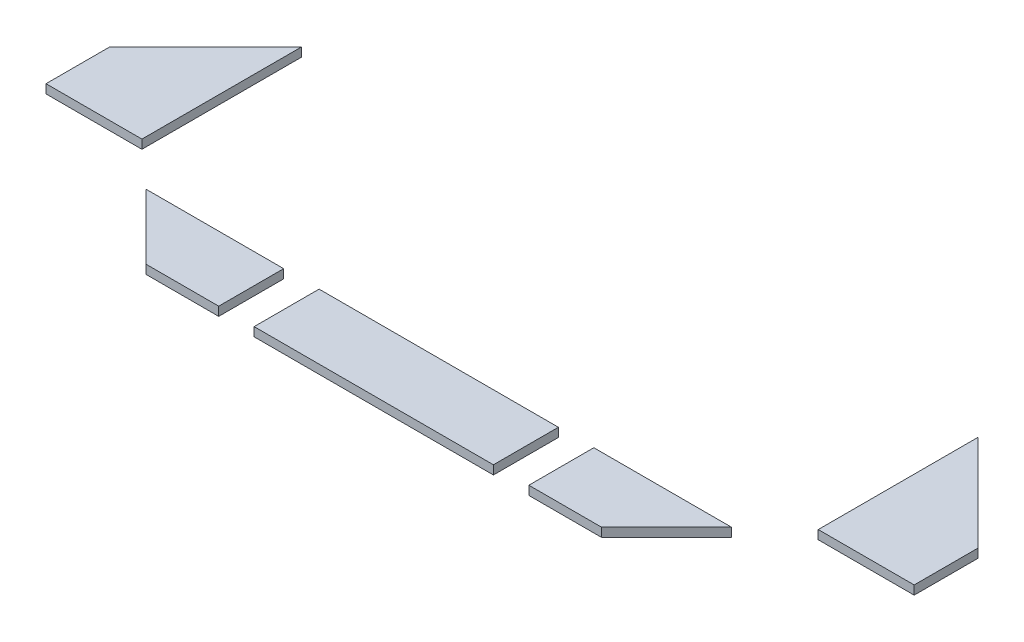
ISO-10303-21;
HEADER;
FILE_DESCRIPTION(('STEP AP214'),'2;1');
FILE_NAME('part.step','',(''),(''),'','','');
FILE_SCHEMA(('AUTOMOTIVE_DESIGN { 1 0 10303 214 1 1 1 1 }'));
ENDSEC;
DATA;
#1=APPLICATION_CONTEXT('core data for automotive mechanical design processes');
#2=APPLICATION_PROTOCOL_DEFINITION('international standard','automotive_design',2000,#1);
#3=PRODUCT_CONTEXT('',#1,'mechanical');
#4=PRODUCT('Part','Part','',(#3));
#5=PRODUCT_RELATED_PRODUCT_CATEGORY('part','',(#4));
#6=PRODUCT_DEFINITION_FORMATION('','',#4);
#7=PRODUCT_DEFINITION_CONTEXT('part definition',#1,'design');
#8=PRODUCT_DEFINITION('design','',#6,#7);
#9=PRODUCT_DEFINITION_SHAPE('','',#8);
#10=(LENGTH_UNIT() NAMED_UNIT(*) SI_UNIT(.MILLI.,.METRE.));
#11=(NAMED_UNIT(*) PLANE_ANGLE_UNIT() SI_UNIT($,.RADIAN.));
#12=(NAMED_UNIT(*) SI_UNIT($,.STERADIAN.) SOLID_ANGLE_UNIT());
#13=UNCERTAINTY_MEASURE_WITH_UNIT(LENGTH_MEASURE(1.E-05),#10,'distance_accuracy_value','');
#14=(GEOMETRIC_REPRESENTATION_CONTEXT(3) GLOBAL_UNCERTAINTY_ASSIGNED_CONTEXT((#13)) GLOBAL_UNIT_ASSIGNED_CONTEXT((#10,
#11,#12)) REPRESENTATION_CONTEXT('',''));
#15=CARTESIAN_POINT('',(0.,0.,0.));
#16=DIRECTION('',(0.,0.,1.));
#17=DIRECTION('',(1.,0.,0.));
#18=AXIS2_PLACEMENT_3D('',#15,#16,#17);
#19=CARTESIAN_POINT('',(59.3076118445742,1.5,-0.499999999999998));
#20=DIRECTION('',(-0.707106781186547,0.,-0.707106781186548));
#21=DIRECTION('',(-0.707106781186548,0.,0.707106781186547));
#22=AXIS2_PLACEMENT_3D('',#19,#20,#21);
#23=PLANE('',#22);
#24=DIRECTION('',(0.707106781186548,0.,-0.707106781186547));
#25=VECTOR('',#24,1.);
#26=CARTESIAN_POINT('',(59.3076118445742,0.,-0.499999999999998));
#27=LINE('',#26,#25);
#28=CARTESIAN_POINT('',(59.3076118445742,0.,-0.499999999999998));
#29=VERTEX_POINT('',#28);
#30=CARTESIAN_POINT('',(70.3076118445748,0.,-11.5000000000006));
#31=VERTEX_POINT('',#30);
#32=EDGE_CURVE('E107',#29,#31,#27,.T.);
#33=ORIENTED_EDGE('',*,*,#32,.T.);
#34=DIRECTION('',(0.,-1.,0.));
#35=VECTOR('',#34,1.);
#36=CARTESIAN_POINT('',(70.3076118445748,1.5,-11.5000000000006));
#37=LINE('',#36,#35);
#38=CARTESIAN_POINT('',(70.3076118445748,1.5,-11.5000000000006));
#39=VERTEX_POINT('',#38);
#40=EDGE_CURVE('E12',#39,#31,#37,.T.);
#41=ORIENTED_EDGE('',*,*,#40,.F.);
#42=DIRECTION('',(0.707106781186548,0.,-0.707106781186547));
#43=VECTOR('',#42,1.);
#44=CARTESIAN_POINT('',(59.3076118445742,1.5,-0.499999999999998));
#45=LINE('',#44,#43);
#46=CARTESIAN_POINT('',(59.3076118445742,1.5,-0.499999999999998));
#47=VERTEX_POINT('',#46);
#48=EDGE_CURVE('E95',#47,#39,#45,.T.);
#49=ORIENTED_EDGE('',*,*,#48,.F.);
#50=DIRECTION('',(0.,-1.,0.));
#51=VECTOR('',#50,1.);
#52=CARTESIAN_POINT('',(59.3076118445742,1.5,-0.499999999999998));
#53=LINE('',#52,#51);
#54=EDGE_CURVE('E103',#47,#29,#53,.T.);
#55=ORIENTED_EDGE('',*,*,#54,.T.);
#56=EDGE_LOOP('',(#33,#41,#49,#55));
#57=FACE_BOUND('',#56,.T.);
#58=ADVANCED_FACE('F44',(#57),#23,.F.);
#59=CARTESIAN_POINT('',(70.3076118445748,1.5,-11.5000000000006));
#60=DIRECTION('',(0.,0.,1.));
#61=DIRECTION('',(1.,0.,0.));
#62=AXIS2_PLACEMENT_3D('',#59,#60,#61);
#63=PLANE('',#62);
#64=DIRECTION('',(-1.,0.,0.));
#65=VECTOR('',#64,1.);
#66=CARTESIAN_POINT('',(70.3076118445748,0.,-11.5000000000006));
#67=LINE('',#66,#65);
#68=CARTESIAN_POINT('',(47.0147186257613,0.,-11.5000000000006));
#69=VERTEX_POINT('',#68);
#70=EDGE_CURVE('E99',#31,#69,#67,.T.);
#71=ORIENTED_EDGE('',*,*,#70,.T.);
#72=DIRECTION('',(0.,-1.,0.));
#73=VECTOR('',#72,1.);
#74=CARTESIAN_POINT('',(47.0147186257613,1.5,-11.5000000000006));
#75=LINE('',#74,#73);
#76=CARTESIAN_POINT('',(47.0147186257613,1.5,-11.5000000000006));
#77=VERTEX_POINT('',#76);
#78=EDGE_CURVE('E52',#77,#69,#75,.T.);
#79=ORIENTED_EDGE('',*,*,#78,.F.);
#80=DIRECTION('',(-1.,0.,0.));
#81=VECTOR('',#80,1.);
#82=CARTESIAN_POINT('',(70.3076118445748,1.5,-11.5000000000006));
#83=LINE('',#82,#81);
#84=EDGE_CURVE('E90',#39,#77,#83,.T.);
#85=ORIENTED_EDGE('',*,*,#84,.F.);
#86=ORIENTED_EDGE('',*,*,#40,.T.);
#87=EDGE_LOOP('',(#71,#79,#85,#86));
#88=FACE_BOUND('',#87,.T.);
#89=ADVANCED_FACE('F98',(#88),#63,.F.);
#90=CARTESIAN_POINT('',(47.0147186257613,1.5,-11.5000000000006));
#91=DIRECTION('',(1.,0.,0.));
#92=DIRECTION('',(0.,0.,-1.));
#93=AXIS2_PLACEMENT_3D('',#90,#91,#92);
#94=PLANE('',#93);
#95=DIRECTION('',(0.,0.,1.));
#96=VECTOR('',#95,1.);
#97=CARTESIAN_POINT('',(47.0147186257613,0.,-11.5000000000006));
#98=LINE('',#97,#96);
#99=CARTESIAN_POINT('',(47.0147186257613,0.,-0.5));
#100=VERTEX_POINT('',#99);
#101=EDGE_CURVE('E77',#69,#100,#98,.T.);
#102=ORIENTED_EDGE('',*,*,#101,.T.);
#103=DIRECTION('',(0.,-1.,0.));
#104=VECTOR('',#103,1.);
#105=CARTESIAN_POINT('',(47.0147186257613,1.5,-0.5));
#106=LINE('',#105,#104);
#107=CARTESIAN_POINT('',(47.0147186257613,1.5,-0.5));
#108=VERTEX_POINT('',#107);
#109=EDGE_CURVE('E100',#108,#100,#106,.T.);
#110=ORIENTED_EDGE('',*,*,#109,.F.);
#111=DIRECTION('',(0.,0.,1.));
#112=VECTOR('',#111,1.);
#113=CARTESIAN_POINT('',(47.0147186257613,1.5,-11.5000000000006));
#114=LINE('',#113,#112);
#115=EDGE_CURVE('E93',#77,#108,#114,.T.);
#116=ORIENTED_EDGE('',*,*,#115,.F.);
#117=ORIENTED_EDGE('',*,*,#78,.T.);
#118=EDGE_LOOP('',(#102,#110,#116,#117));
#119=FACE_BOUND('',#118,.T.);
#120=ADVANCED_FACE('F101',(#119),#94,.F.);
#121=CARTESIAN_POINT('',(47.0147186257613,1.5,-0.5));
#122=DIRECTION('',(0.,0.,-1.));
#123=DIRECTION('',(-1.,0.,0.));
#124=AXIS2_PLACEMENT_3D('',#121,#122,#123);
#125=PLANE('',#124);
#126=DIRECTION('',(1.,0.,0.));
#127=VECTOR('',#126,1.);
#128=CARTESIAN_POINT('',(47.0147186257613,0.,-0.5));
#129=LINE('',#128,#127);
#130=EDGE_CURVE('E83',#100,#29,#129,.T.);
#131=ORIENTED_EDGE('',*,*,#130,.T.);
#132=ORIENTED_EDGE('',*,*,#54,.F.);
#133=DIRECTION('',(1.,0.,0.));
#134=VECTOR('',#133,1.);
#135=CARTESIAN_POINT('',(47.0147186257613,1.5,-0.5));
#136=LINE('',#135,#134);
#137=EDGE_CURVE('E60',#108,#47,#136,.T.);
#138=ORIENTED_EDGE('',*,*,#137,.F.);
#139=ORIENTED_EDGE('',*,*,#109,.T.);
#140=EDGE_LOOP('',(#131,#132,#138,#139));
#141=FACE_BOUND('',#140,.T.);
#142=ADVANCED_FACE('F114',(#141),#125,.F.);
#143=CARTESIAN_POINT('',(0.,1.5,0.));
#144=DIRECTION('',(0.,1.,0.));
#145=DIRECTION('',(0.,0.,1.));
#146=AXIS2_PLACEMENT_3D('',#143,#144,#145);
#147=PLANE('',#146);
#148=ORIENTED_EDGE('',*,*,#48,.T.);
#149=ORIENTED_EDGE('',*,*,#84,.T.);
#150=ORIENTED_EDGE('',*,*,#115,.T.);
#151=ORIENTED_EDGE('',*,*,#137,.T.);
#152=EDGE_LOOP('',(#148,#149,#150,#151));
#153=FACE_BOUND('',#152,.T.);
#154=ADVANCED_FACE('F91',(#153),#147,.T.);
#155=CARTESIAN_POINT('',(0.,0.,0.));
#156=DIRECTION('',(0.,1.,0.));
#157=DIRECTION('',(0.,0.,1.));
#158=AXIS2_PLACEMENT_3D('',#155,#156,#157);
#159=PLANE('',#158);
#160=ORIENTED_EDGE('',*,*,#32,.F.);
#161=ORIENTED_EDGE('',*,*,#130,.F.);
#162=ORIENTED_EDGE('',*,*,#101,.F.);
#163=ORIENTED_EDGE('',*,*,#70,.F.);
#164=EDGE_LOOP('',(#160,#161,#162,#163));
#165=FACE_BOUND('',#164,.T.);
#166=ADVANCED_FACE('F117',(#165),#159,.F.);
#167=CLOSED_SHELL('',(#58,#89,#120,#142,#154,#166));
#168=MANIFOLD_SOLID_BREP('B2',#167);
#169=CARTESIAN_POINT('',(78.0147186257614,1.5,-18.5000000000006));
#170=DIRECTION('',(1.,0.,0.));
#171=DIRECTION('',(0.,0.,-1.));
#172=AXIS2_PLACEMENT_3D('',#169,#170,#171);
#173=PLANE('',#172);
#174=DIRECTION('',(0.,0.,1.));
#175=VECTOR('',#174,1.);
#176=CARTESIAN_POINT('',(78.0147186257614,0.,-18.5000000000006));
#177=LINE('',#176,#175);
#178=CARTESIAN_POINT('',(78.0147186257614,0.,-45.5000000000006));
#179=VERTEX_POINT('',#178);
#180=CARTESIAN_POINT('',(78.0147186257614,0.,-18.5000000000006));
#181=VERTEX_POINT('',#180);
#182=EDGE_CURVE('E252',#179,#181,#177,.T.);
#183=ORIENTED_EDGE('',*,*,#182,.T.);
#184=DIRECTION('',(0.,-1.,0.));
#185=VECTOR('',#184,1.);
#186=CARTESIAN_POINT('',(78.0147186257614,1.5,-18.5000000000006));
#187=LINE('',#186,#185);
#188=CARTESIAN_POINT('',(78.0147186257614,1.5,-18.5000000000006));
#189=VERTEX_POINT('',#188);
#190=EDGE_CURVE('E42',#189,#181,#187,.T.);
#191=ORIENTED_EDGE('',*,*,#190,.F.);
#192=DIRECTION('',(0.,0.,1.));
#193=VECTOR('',#192,1.);
#194=CARTESIAN_POINT('',(78.0147186257614,1.5,-18.5000000000006));
#195=LINE('',#194,#193);
#196=CARTESIAN_POINT('',(78.0147186257614,1.5,-45.5000000000006));
#197=VERTEX_POINT('',#196);
#198=EDGE_CURVE('E260',#197,#189,#195,.T.);
#199=ORIENTED_EDGE('',*,*,#198,.F.);
#200=DIRECTION('',(0.,-1.,0.));
#201=VECTOR('',#200,1.);
#202=CARTESIAN_POINT('',(78.0147186257614,1.5,-45.5000000000006));
#203=LINE('',#202,#201);
#204=EDGE_CURVE('E248',#197,#179,#203,.T.);
#205=ORIENTED_EDGE('',*,*,#204,.T.);
#206=EDGE_LOOP('',(#183,#191,#199,#205));
#207=FACE_BOUND('',#206,.T.);
#208=ADVANCED_FACE('F178',(#207),#173,.F.);
#209=CARTESIAN_POINT('',(94.2573593128806,1.5,-18.5000000000006));
#210=DIRECTION('',(0.,0.,-1.));
#211=DIRECTION('',(-1.,0.,0.));
#212=AXIS2_PLACEMENT_3D('',#209,#210,#211);
#213=PLANE('',#212);
#214=DIRECTION('',(1.,0.,0.));
#215=VECTOR('',#214,1.);
#216=CARTESIAN_POINT('',(94.2573593128806,0.,-18.5000000000006));
#217=LINE('',#216,#215);
#218=CARTESIAN_POINT('',(94.2573593128806,0.,-18.5000000000006));
#219=VERTEX_POINT('',#218);
#220=EDGE_CURVE('E255',#181,#219,#217,.T.);
#221=ORIENTED_EDGE('',*,*,#220,.T.);
#222=DIRECTION('',(0.,-1.,0.));
#223=VECTOR('',#222,1.);
#224=CARTESIAN_POINT('',(94.2573593128806,1.5,-18.5000000000006));
#225=LINE('',#224,#223);
#226=CARTESIAN_POINT('',(94.2573593128806,1.5,-18.5000000000006));
#227=VERTEX_POINT('',#226);
#228=EDGE_CURVE('E186',#227,#219,#225,.T.);
#229=ORIENTED_EDGE('',*,*,#228,.F.);
#230=DIRECTION('',(1.,0.,0.));
#231=VECTOR('',#230,1.);
#232=CARTESIAN_POINT('',(94.2573593128806,1.5,-18.5000000000006));
#233=LINE('',#232,#231);
#234=EDGE_CURVE('E228',#189,#227,#233,.T.);
#235=ORIENTED_EDGE('',*,*,#234,.F.);
#236=ORIENTED_EDGE('',*,*,#190,.T.);
#237=EDGE_LOOP('',(#221,#229,#235,#236));
#238=FACE_BOUND('',#237,.T.);
#239=ADVANCED_FACE('F279',(#238),#213,.F.);
#240=CARTESIAN_POINT('',(94.2573593128806,1.5,-29.3076118445755));
#241=DIRECTION('',(-1.,0.,0.));
#242=DIRECTION('',(0.,0.,1.));
#243=AXIS2_PLACEMENT_3D('',#240,#241,#242);
#244=PLANE('',#243);
#245=DIRECTION('',(0.,0.,-1.));
#246=VECTOR('',#245,1.);
#247=CARTESIAN_POINT('',(94.2573593128806,0.,-29.3076118445755));
#248=LINE('',#247,#246);
#249=CARTESIAN_POINT('',(94.2573593128806,0.,-29.3076118445755));
#250=VERTEX_POINT('',#249);
#251=EDGE_CURVE('E243',#219,#250,#248,.T.);
#252=ORIENTED_EDGE('',*,*,#251,.T.);
#253=DIRECTION('',(0.,-1.,0.));
#254=VECTOR('',#253,1.);
#255=CARTESIAN_POINT('',(94.2573593128806,1.5,-29.3076118445755));
#256=LINE('',#255,#254);
#257=CARTESIAN_POINT('',(94.2573593128806,1.5,-29.3076118445755));
#258=VERTEX_POINT('',#257);
#259=EDGE_CURVE('E240',#258,#250,#256,.T.);
#260=ORIENTED_EDGE('',*,*,#259,.F.);
#261=DIRECTION('',(0.,0.,-1.));
#262=VECTOR('',#261,1.);
#263=CARTESIAN_POINT('',(94.2573593128806,1.5,-29.3076118445755));
#264=LINE('',#263,#262);
#265=EDGE_CURVE('E232',#227,#258,#264,.T.);
#266=ORIENTED_EDGE('',*,*,#265,.F.);
#267=ORIENTED_EDGE('',*,*,#228,.T.);
#268=EDGE_LOOP('',(#252,#260,#266,#267));
#269=FACE_BOUND('',#268,.T.);
#270=ADVANCED_FACE('F241',(#269),#244,.F.);
#271=CARTESIAN_POINT('',(78.0649711574555,1.5,-45.5000000000006));
#272=DIRECTION('',(-0.707106781186548,0.,0.707106781186547));
#273=DIRECTION('',(0.707106781186547,0.,0.707106781186548));
#274=AXIS2_PLACEMENT_3D('',#271,#272,#273);
#275=PLANE('',#274);
#276=DIRECTION('',(-0.707106781186547,0.,-0.707106781186548));
#277=VECTOR('',#276,1.);
#278=CARTESIAN_POINT('',(78.0649711574555,0.,-45.5000000000006));
#279=LINE('',#278,#277);
#280=CARTESIAN_POINT('',(78.0649711574555,0.,-45.5000000000006));
#281=VERTEX_POINT('',#280);
#282=EDGE_CURVE('E214',#250,#281,#279,.T.);
#283=ORIENTED_EDGE('',*,*,#282,.T.);
#284=DIRECTION('',(0.,-1.,0.));
#285=VECTOR('',#284,1.);
#286=CARTESIAN_POINT('',(78.0649711574555,1.5,-45.5000000000006));
#287=LINE('',#286,#285);
#288=CARTESIAN_POINT('',(78.0649711574555,1.5,-45.5000000000006));
#289=VERTEX_POINT('',#288);
#290=EDGE_CURVE('E244',#289,#281,#287,.T.);
#291=ORIENTED_EDGE('',*,*,#290,.F.);
#292=DIRECTION('',(-0.707106781186547,0.,-0.707106781186548));
#293=VECTOR('',#292,1.);
#294=CARTESIAN_POINT('',(78.0649711574555,1.5,-45.5000000000006));
#295=LINE('',#294,#293);
#296=EDGE_CURVE('E236',#258,#289,#295,.T.);
#297=ORIENTED_EDGE('',*,*,#296,.F.);
#298=ORIENTED_EDGE('',*,*,#259,.T.);
#299=EDGE_LOOP('',(#283,#291,#297,#298));
#300=FACE_BOUND('',#299,.T.);
#301=ADVANCED_FACE('F246',(#300),#275,.F.);
#302=CARTESIAN_POINT('',(78.0147186257614,1.5,-45.5000000000006));
#303=DIRECTION('',(0.,0.,1.));
#304=DIRECTION('',(1.,0.,0.));
#305=AXIS2_PLACEMENT_3D('',#302,#303,#304);
#306=PLANE('',#305);
#307=DIRECTION('',(-1.,0.,0.));
#308=VECTOR('',#307,1.);
#309=CARTESIAN_POINT('',(78.0147186257614,0.,-45.5000000000006));
#310=LINE('',#309,#308);
#311=EDGE_CURVE('E220',#281,#179,#310,.T.);
#312=ORIENTED_EDGE('',*,*,#311,.T.);
#313=ORIENTED_EDGE('',*,*,#204,.F.);
#314=DIRECTION('',(-1.,0.,0.));
#315=VECTOR('',#314,1.);
#316=CARTESIAN_POINT('',(78.0147186257614,1.5,-45.5000000000006));
#317=LINE('',#316,#315);
#318=EDGE_CURVE('E194',#289,#197,#317,.T.);
#319=ORIENTED_EDGE('',*,*,#318,.F.);
#320=ORIENTED_EDGE('',*,*,#290,.T.);
#321=EDGE_LOOP('',(#312,#313,#319,#320));
#322=FACE_BOUND('',#321,.T.);
#323=ADVANCED_FACE('F268',(#322),#306,.F.);
#324=CARTESIAN_POINT('',(0.,1.5,0.));
#325=DIRECTION('',(0.,-1.,0.));
#326=DIRECTION('',(0.,0.,-1.));
#327=AXIS2_PLACEMENT_3D('',#324,#325,#326);
#328=PLANE('',#327);
#329=ORIENTED_EDGE('',*,*,#198,.T.);
#330=ORIENTED_EDGE('',*,*,#234,.T.);
#331=ORIENTED_EDGE('',*,*,#265,.T.);
#332=ORIENTED_EDGE('',*,*,#296,.T.);
#333=ORIENTED_EDGE('',*,*,#318,.T.);
#334=EDGE_LOOP('',(#329,#330,#331,#332,#333));
#335=FACE_BOUND('',#334,.T.);
#336=ADVANCED_FACE('F234',(#335),#328,.F.);
#337=CARTESIAN_POINT('',(0.,0.,0.));
#338=DIRECTION('',(0.,-1.,0.));
#339=DIRECTION('',(0.,0.,-1.));
#340=AXIS2_PLACEMENT_3D('',#337,#338,#339);
#341=PLANE('',#340);
#342=ORIENTED_EDGE('',*,*,#182,.F.);
#343=ORIENTED_EDGE('',*,*,#311,.F.);
#344=ORIENTED_EDGE('',*,*,#282,.F.);
#345=ORIENTED_EDGE('',*,*,#251,.F.);
#346=ORIENTED_EDGE('',*,*,#220,.F.);
#347=EDGE_LOOP('',(#342,#343,#344,#345,#346));
#348=FACE_BOUND('',#347,.T.);
#349=ADVANCED_FACE('F264',(#348),#341,.T.);
#350=CLOSED_SHELL('',(#208,#239,#270,#301,#323,#336,#349));
#351=MANIFOLD_SOLID_BREP('B6',#350);
#352=CARTESIAN_POINT('',(-52.7426406871193,1.5,-18.5000000000006));
#353=DIRECTION('',(0.,0.,-1.));
#354=DIRECTION('',(-1.,0.,0.));
#355=AXIS2_PLACEMENT_3D('',#352,#353,#354);
#356=PLANE('',#355);
#357=DIRECTION('',(1.,0.,0.));
#358=VECTOR('',#357,1.);
#359=CARTESIAN_POINT('',(-52.7426406871193,0.,-18.5000000000006));
#360=LINE('',#359,#358);
#361=CARTESIAN_POINT('',(-52.7426406871193,0.,-18.5000000000006));
#362=VERTEX_POINT('',#361);
#363=CARTESIAN_POINT('',(-36.5000000000001,0.,-18.5000000000006));
#364=VERTEX_POINT('',#363);
#365=EDGE_CURVE('E412',#362,#364,#360,.T.);
#366=ORIENTED_EDGE('',*,*,#365,.T.);
#367=DIRECTION('',(0.,-1.,0.));
#368=VECTOR('',#367,1.);
#369=CARTESIAN_POINT('',(-36.5000000000001,1.5,-18.5000000000006));
#370=LINE('',#369,#368);
#371=CARTESIAN_POINT('',(-36.5000000000001,1.5,-18.5000000000006));
#372=VERTEX_POINT('',#371);
#373=EDGE_CURVE('E176',#372,#364,#370,.T.);
#374=ORIENTED_EDGE('',*,*,#373,.F.);
#375=DIRECTION('',(1.,0.,0.));
#376=VECTOR('',#375,1.);
#377=CARTESIAN_POINT('',(-52.7426406871193,1.5,-18.5000000000006));
#378=LINE('',#377,#376);
#379=CARTESIAN_POINT('',(-52.7426406871193,1.5,-18.5000000000006));
#380=VERTEX_POINT('',#379);
#381=EDGE_CURVE('E420',#380,#372,#378,.T.);
#382=ORIENTED_EDGE('',*,*,#381,.F.);
#383=DIRECTION('',(0.,-1.,0.));
#384=VECTOR('',#383,1.);
#385=CARTESIAN_POINT('',(-52.7426406871193,1.5,-18.5000000000006));
#386=LINE('',#385,#384);
#387=EDGE_CURVE('E408',#380,#362,#386,.T.);
#388=ORIENTED_EDGE('',*,*,#387,.T.);
#389=EDGE_LOOP('',(#366,#374,#382,#388));
#390=FACE_BOUND('',#389,.T.);
#391=ADVANCED_FACE('F338',(#390),#356,.F.);
#392=CARTESIAN_POINT('',(-36.5000000000001,1.5,-18.5000000000006));
#393=DIRECTION('',(-1.,0.,0.));
#394=DIRECTION('',(0.,0.,1.));
#395=AXIS2_PLACEMENT_3D('',#392,#393,#394);
#396=PLANE('',#395);
#397=DIRECTION('',(0.,0.,-1.));
#398=VECTOR('',#397,1.);
#399=CARTESIAN_POINT('',(-36.5000000000001,0.,-18.5000000000006));
#400=LINE('',#399,#398);
#401=CARTESIAN_POINT('',(-36.5000000000001,0.,-45.5000000000006));
#402=VERTEX_POINT('',#401);
#403=EDGE_CURVE('E415',#364,#402,#400,.T.);
#404=ORIENTED_EDGE('',*,*,#403,.T.);
#405=DIRECTION('',(0.,-1.,0.));
#406=VECTOR('',#405,1.);
#407=CARTESIAN_POINT('',(-36.5000000000001,1.5,-45.5000000000006));
#408=LINE('',#407,#406);
#409=CARTESIAN_POINT('',(-36.5000000000001,1.5,-45.5000000000006));
#410=VERTEX_POINT('',#409);
#411=EDGE_CURVE('E346',#410,#402,#408,.T.);
#412=ORIENTED_EDGE('',*,*,#411,.F.);
#413=DIRECTION('',(0.,0.,-1.));
#414=VECTOR('',#413,1.);
#415=CARTESIAN_POINT('',(-36.5000000000001,1.5,-18.5000000000006));
#416=LINE('',#415,#414);
#417=EDGE_CURVE('E388',#372,#410,#416,.T.);
#418=ORIENTED_EDGE('',*,*,#417,.F.);
#419=ORIENTED_EDGE('',*,*,#373,.T.);
#420=EDGE_LOOP('',(#404,#412,#418,#419));
#421=FACE_BOUND('',#420,.T.);
#422=ADVANCED_FACE('F439',(#421),#396,.F.);
#423=CARTESIAN_POINT('',(-36.5000000000001,1.5,-45.5000000000006));
#424=DIRECTION('',(0.,0.,1.));
#425=DIRECTION('',(1.,0.,0.));
#426=AXIS2_PLACEMENT_3D('',#423,#424,#425);
#427=PLANE('',#426);
#428=DIRECTION('',(-1.,0.,0.));
#429=VECTOR('',#428,1.);
#430=CARTESIAN_POINT('',(-36.5000000000001,0.,-45.5000000000006));
#431=LINE('',#430,#429);
#432=CARTESIAN_POINT('',(-36.5502525316942,0.,-45.5000000000006));
#433=VERTEX_POINT('',#432);
#434=EDGE_CURVE('E403',#402,#433,#431,.T.);
#435=ORIENTED_EDGE('',*,*,#434,.T.);
#436=DIRECTION('',(0.,-1.,0.));
#437=VECTOR('',#436,1.);
#438=CARTESIAN_POINT('',(-36.5502525316942,1.5,-45.5000000000006));
#439=LINE('',#438,#437);
#440=CARTESIAN_POINT('',(-36.5502525316942,1.5,-45.5000000000006));
#441=VERTEX_POINT('',#440);
#442=EDGE_CURVE('E400',#441,#433,#439,.T.);
#443=ORIENTED_EDGE('',*,*,#442,.F.);
#444=DIRECTION('',(-1.,0.,0.));
#445=VECTOR('',#444,1.);
#446=CARTESIAN_POINT('',(-36.5000000000001,1.5,-45.5000000000006));
#447=LINE('',#446,#445);
#448=EDGE_CURVE('E392',#410,#441,#447,.T.);
#449=ORIENTED_EDGE('',*,*,#448,.F.);
#450=ORIENTED_EDGE('',*,*,#411,.T.);
#451=EDGE_LOOP('',(#435,#443,#449,#450));
#452=FACE_BOUND('',#451,.T.);
#453=ADVANCED_FACE('F401',(#452),#427,.F.);
#454=CARTESIAN_POINT('',(-36.5502525316942,1.5,-45.5000000000006));
#455=DIRECTION('',(0.707106781186548,0.,0.707106781186547));
#456=DIRECTION('',(0.707106781186547,0.,-0.707106781186548));
#457=AXIS2_PLACEMENT_3D('',#454,#455,#456);
#458=PLANE('',#457);
#459=DIRECTION('',(-0.707106781186547,0.,0.707106781186548));
#460=VECTOR('',#459,1.);
#461=CARTESIAN_POINT('',(-36.5502525316942,0.,-45.5000000000006));
#462=LINE('',#461,#460);
#463=CARTESIAN_POINT('',(-52.7426406871193,0.,-29.3076118445755));
#464=VERTEX_POINT('',#463);
#465=EDGE_CURVE('E374',#433,#464,#462,.T.);
#466=ORIENTED_EDGE('',*,*,#465,.T.);
#467=DIRECTION('',(0.,-1.,0.));
#468=VECTOR('',#467,1.);
#469=CARTESIAN_POINT('',(-52.7426406871193,1.5,-29.3076118445755));
#470=LINE('',#469,#468);
#471=CARTESIAN_POINT('',(-52.7426406871193,1.5,-29.3076118445755));
#472=VERTEX_POINT('',#471);
#473=EDGE_CURVE('E404',#472,#464,#470,.T.);
#474=ORIENTED_EDGE('',*,*,#473,.F.);
#475=DIRECTION('',(-0.707106781186547,0.,0.707106781186548));
#476=VECTOR('',#475,1.);
#477=CARTESIAN_POINT('',(-36.5502525316942,1.5,-45.5000000000006));
#478=LINE('',#477,#476);
#479=EDGE_CURVE('E396',#441,#472,#478,.T.);
#480=ORIENTED_EDGE('',*,*,#479,.F.);
#481=ORIENTED_EDGE('',*,*,#442,.T.);
#482=EDGE_LOOP('',(#466,#474,#480,#481));
#483=FACE_BOUND('',#482,.T.);
#484=ADVANCED_FACE('F406',(#483),#458,.F.);
#485=CARTESIAN_POINT('',(-52.7426406871193,1.5,-29.3076118445755));
#486=DIRECTION('',(1.,0.,0.));
#487=DIRECTION('',(0.,0.,-1.));
#488=AXIS2_PLACEMENT_3D('',#485,#486,#487);
#489=PLANE('',#488);
#490=DIRECTION('',(0.,0.,1.));
#491=VECTOR('',#490,1.);
#492=CARTESIAN_POINT('',(-52.7426406871193,0.,-29.3076118445755));
#493=LINE('',#492,#491);
#494=EDGE_CURVE('E380',#464,#362,#493,.T.);
#495=ORIENTED_EDGE('',*,*,#494,.T.);
#496=ORIENTED_EDGE('',*,*,#387,.F.);
#497=DIRECTION('',(0.,0.,1.));
#498=VECTOR('',#497,1.);
#499=CARTESIAN_POINT('',(-52.7426406871193,1.5,-29.3076118445755));
#500=LINE('',#499,#498);
#501=EDGE_CURVE('E354',#472,#380,#500,.T.);
#502=ORIENTED_EDGE('',*,*,#501,.F.);
#503=ORIENTED_EDGE('',*,*,#473,.T.);
#504=EDGE_LOOP('',(#495,#496,#502,#503));
#505=FACE_BOUND('',#504,.T.);
#506=ADVANCED_FACE('F428',(#505),#489,.F.);
#507=CARTESIAN_POINT('',(0.,1.5,0.));
#508=DIRECTION('',(0.,1.,0.));
#509=DIRECTION('',(0.,0.,1.));
#510=AXIS2_PLACEMENT_3D('',#507,#508,#509);
#511=PLANE('',#510);
#512=ORIENTED_EDGE('',*,*,#381,.T.);
#513=ORIENTED_EDGE('',*,*,#417,.T.);
#514=ORIENTED_EDGE('',*,*,#448,.T.);
#515=ORIENTED_EDGE('',*,*,#479,.T.);
#516=ORIENTED_EDGE('',*,*,#501,.T.);
#517=EDGE_LOOP('',(#512,#513,#514,#515,#516));
#518=FACE_BOUND('',#517,.T.);
#519=ADVANCED_FACE('F394',(#518),#511,.T.);
#520=CARTESIAN_POINT('',(0.,0.,0.));
#521=DIRECTION('',(0.,1.,0.));
#522=DIRECTION('',(0.,0.,1.));
#523=AXIS2_PLACEMENT_3D('',#520,#521,#522);
#524=PLANE('',#523);
#525=ORIENTED_EDGE('',*,*,#365,.F.);
#526=ORIENTED_EDGE('',*,*,#494,.F.);
#527=ORIENTED_EDGE('',*,*,#465,.F.);
#528=ORIENTED_EDGE('',*,*,#434,.F.);
#529=ORIENTED_EDGE('',*,*,#403,.F.);
#530=EDGE_LOOP('',(#525,#526,#527,#528,#529));
#531=FACE_BOUND('',#530,.T.);
#532=ADVANCED_FACE('F424',(#531),#524,.F.);
#533=CLOSED_SHELL('',(#391,#422,#453,#484,#506,#519,#532));
#534=MANIFOLD_SOLID_BREP('B36',#533);
#535=CARTESIAN_POINT('',(-5.5,1.5,-0.5));
#536=DIRECTION('',(0.,0.,-1.));
#537=DIRECTION('',(-1.,0.,0.));
#538=AXIS2_PLACEMENT_3D('',#535,#536,#537);
#539=PLANE('',#538);
#540=DIRECTION('',(1.,0.,0.));
#541=VECTOR('',#540,1.);
#542=CARTESIAN_POINT('',(-5.5,0.,-0.5));
#543=LINE('',#542,#541);
#544=CARTESIAN_POINT('',(-17.7928932188129,0.,-0.499999999999998));
#545=VERTEX_POINT('',#544);
#546=CARTESIAN_POINT('',(-5.5,0.,-0.5));
#547=VERTEX_POINT('',#546);
#548=EDGE_CURVE('E560',#545,#547,#543,.T.);
#549=ORIENTED_EDGE('',*,*,#548,.T.);
#550=DIRECTION('',(0.,-1.,0.));
#551=VECTOR('',#550,1.);
#552=CARTESIAN_POINT('',(-5.5,1.5,-0.5));
#553=LINE('',#552,#551);
#554=CARTESIAN_POINT('',(-5.5,1.5,-0.5));
#555=VERTEX_POINT('',#554);
#556=EDGE_CURVE('E336',#555,#547,#553,.T.);
#557=ORIENTED_EDGE('',*,*,#556,.F.);
#558=DIRECTION('',(1.,0.,0.));
#559=VECTOR('',#558,1.);
#560=CARTESIAN_POINT('',(-5.5,1.5,-0.5));
#561=LINE('',#560,#559);
#562=CARTESIAN_POINT('',(-17.7928932188129,1.5,-0.499999999999998));
#563=VERTEX_POINT('',#562);
#564=EDGE_CURVE('E548',#563,#555,#561,.T.);
#565=ORIENTED_EDGE('',*,*,#564,.F.);
#566=DIRECTION('',(0.,-1.,0.));
#567=VECTOR('',#566,1.);
#568=CARTESIAN_POINT('',(-17.7928932188129,1.5,-0.499999999999998));
#569=LINE('',#568,#567);
#570=EDGE_CURVE('E556',#563,#545,#569,.T.);
#571=ORIENTED_EDGE('',*,*,#570,.T.);
#572=EDGE_LOOP('',(#549,#557,#565,#571));
#573=FACE_BOUND('',#572,.T.);
#574=ADVANCED_FACE('F497',(#573),#539,.F.);
#575=CARTESIAN_POINT('',(-5.50000000000001,1.5,-11.5000000000006));
#576=DIRECTION('',(-1.,0.,0.));
#577=DIRECTION('',(0.,0.,1.));
#578=AXIS2_PLACEMENT_3D('',#575,#576,#577);
#579=PLANE('',#578);
#580=DIRECTION('',(0.,0.,-1.));
#581=VECTOR('',#580,1.);
#582=CARTESIAN_POINT('',(-5.50000000000001,0.,-11.5000000000006));
#583=LINE('',#582,#581);
#584=CARTESIAN_POINT('',(-5.50000000000001,0.,-11.5000000000006));
#585=VERTEX_POINT('',#584);
#586=EDGE_CURVE('E552',#547,#585,#583,.T.);
#587=ORIENTED_EDGE('',*,*,#586,.T.);
#588=DIRECTION('',(0.,-1.,0.));
#589=VECTOR('',#588,1.);
#590=CARTESIAN_POINT('',(-5.50000000000001,1.5,-11.5000000000006));
#591=LINE('',#590,#589);
#592=CARTESIAN_POINT('',(-5.50000000000001,1.5,-11.5000000000006));
#593=VERTEX_POINT('',#592);
#594=EDGE_CURVE('E505',#593,#585,#591,.T.);
#595=ORIENTED_EDGE('',*,*,#594,.F.);
#596=DIRECTION('',(0.,0.,-1.));
#597=VECTOR('',#596,1.);
#598=CARTESIAN_POINT('',(-5.50000000000001,1.5,-11.5000000000006));
#599=LINE('',#598,#597);
#600=EDGE_CURVE('E543',#555,#593,#599,.T.);
#601=ORIENTED_EDGE('',*,*,#600,.F.);
#602=ORIENTED_EDGE('',*,*,#556,.T.);
#603=EDGE_LOOP('',(#587,#595,#601,#602));
#604=FACE_BOUND('',#603,.T.);
#605=ADVANCED_FACE('F551',(#604),#579,.F.);
#606=CARTESIAN_POINT('',(-28.7928932188135,1.5,-11.5000000000006));
#607=DIRECTION('',(0.,0.,1.));
#608=DIRECTION('',(1.,0.,0.));
#609=AXIS2_PLACEMENT_3D('',#606,#607,#608);
#610=PLANE('',#609);
#611=DIRECTION('',(-1.,0.,0.));
#612=VECTOR('',#611,1.);
#613=CARTESIAN_POINT('',(-28.7928932188135,0.,-11.5000000000006));
#614=LINE('',#613,#612);
#615=CARTESIAN_POINT('',(-28.7928932188135,0.,-11.5000000000006));
#616=VERTEX_POINT('',#615);
#617=EDGE_CURVE('E530',#585,#616,#614,.T.);
#618=ORIENTED_EDGE('',*,*,#617,.T.);
#619=DIRECTION('',(0.,-1.,0.));
#620=VECTOR('',#619,1.);
#621=CARTESIAN_POINT('',(-28.7928932188135,1.5,-11.5000000000006));
#622=LINE('',#621,#620);
#623=CARTESIAN_POINT('',(-28.7928932188135,1.5,-11.5000000000006));
#624=VERTEX_POINT('',#623);
#625=EDGE_CURVE('E553',#624,#616,#622,.T.);
#626=ORIENTED_EDGE('',*,*,#625,.F.);
#627=DIRECTION('',(-1.,0.,0.));
#628=VECTOR('',#627,1.);
#629=CARTESIAN_POINT('',(-28.7928932188135,1.5,-11.5000000000006));
#630=LINE('',#629,#628);
#631=EDGE_CURVE('E546',#593,#624,#630,.T.);
#632=ORIENTED_EDGE('',*,*,#631,.F.);
#633=ORIENTED_EDGE('',*,*,#594,.T.);
#634=EDGE_LOOP('',(#618,#626,#632,#633));
#635=FACE_BOUND('',#634,.T.);
#636=ADVANCED_FACE('F554',(#635),#610,.F.);
#637=CARTESIAN_POINT('',(-17.7928932188129,1.5,-0.499999999999998));
#638=DIRECTION('',(0.707106781186548,0.,-0.707106781186547));
#639=DIRECTION('',(-0.707106781186547,0.,-0.707106781186548));
#640=AXIS2_PLACEMENT_3D('',#637,#638,#639);
#641=PLANE('',#640);
#642=DIRECTION('',(0.707106781186547,0.,0.707106781186548));
#643=VECTOR('',#642,1.);
#644=CARTESIAN_POINT('',(-17.7928932188129,0.,-0.499999999999998));
#645=LINE('',#644,#643);
#646=EDGE_CURVE('E536',#616,#545,#645,.T.);
#647=ORIENTED_EDGE('',*,*,#646,.T.);
#648=ORIENTED_EDGE('',*,*,#570,.F.);
#649=DIRECTION('',(0.707106781186547,0.,0.707106781186548));
#650=VECTOR('',#649,1.);
#651=CARTESIAN_POINT('',(-17.7928932188129,1.5,-0.499999999999998));
#652=LINE('',#651,#650);
#653=EDGE_CURVE('E513',#624,#563,#652,.T.);
#654=ORIENTED_EDGE('',*,*,#653,.F.);
#655=ORIENTED_EDGE('',*,*,#625,.T.);
#656=EDGE_LOOP('',(#647,#648,#654,#655));
#657=FACE_BOUND('',#656,.T.);
#658=ADVANCED_FACE('F567',(#657),#641,.F.);
#659=CARTESIAN_POINT('',(0.,1.5,0.));
#660=DIRECTION('',(0.,1.,0.));
#661=DIRECTION('',(0.,0.,1.));
#662=AXIS2_PLACEMENT_3D('',#659,#660,#661);
#663=PLANE('',#662);
#664=ORIENTED_EDGE('',*,*,#564,.T.);
#665=ORIENTED_EDGE('',*,*,#600,.T.);
#666=ORIENTED_EDGE('',*,*,#631,.T.);
#667=ORIENTED_EDGE('',*,*,#653,.T.);
#668=EDGE_LOOP('',(#664,#665,#666,#667));
#669=FACE_BOUND('',#668,.T.);
#670=ADVANCED_FACE('F544',(#669),#663,.T.);
#671=CARTESIAN_POINT('',(0.,0.,0.));
#672=DIRECTION('',(0.,1.,0.));
#673=DIRECTION('',(0.,0.,1.));
#674=AXIS2_PLACEMENT_3D('',#671,#672,#673);
#675=PLANE('',#674);
#676=ORIENTED_EDGE('',*,*,#548,.F.);
#677=ORIENTED_EDGE('',*,*,#646,.F.);
#678=ORIENTED_EDGE('',*,*,#617,.F.);
#679=ORIENTED_EDGE('',*,*,#586,.F.);
#680=EDGE_LOOP('',(#676,#677,#678,#679));
#681=FACE_BOUND('',#680,.T.);
#682=ADVANCED_FACE('F570',(#681),#675,.F.);
#683=CLOSED_SHELL('',(#574,#605,#636,#658,#670,#682));
#684=MANIFOLD_SOLID_BREP('B170',#683);
#685=CARTESIAN_POINT('',(0.5,1.5,-0.5));
#686=DIRECTION('',(0.,0.,-1.));
#687=DIRECTION('',(-1.,0.,0.));
#688=AXIS2_PLACEMENT_3D('',#685,#686,#687);
#689=PLANE('',#688);
#690=DIRECTION('',(1.,0.,0.));
#691=VECTOR('',#690,1.);
#692=CARTESIAN_POINT('',(0.5,0.,-0.5));
#693=LINE('',#692,#691);
#694=CARTESIAN_POINT('',(0.5,0.,-0.5));
#695=VERTEX_POINT('',#694);
#696=CARTESIAN_POINT('',(41.0147186257613,0.,-0.5));
#697=VERTEX_POINT('',#696);
#698=EDGE_CURVE('E684',#695,#697,#693,.T.);
#699=ORIENTED_EDGE('',*,*,#698,.T.);
#700=DIRECTION('',(0.,-1.,0.));
#701=VECTOR('',#700,1.);
#702=CARTESIAN_POINT('',(41.0147186257613,1.5,-0.5));
#703=LINE('',#702,#701);
#704=CARTESIAN_POINT('',(41.0147186257613,1.5,-0.5));
#705=VERTEX_POINT('',#704);
#706=EDGE_CURVE('E495',#705,#697,#703,.T.);
#707=ORIENTED_EDGE('',*,*,#706,.F.);
#708=DIRECTION('',(1.,0.,0.));
#709=VECTOR('',#708,1.);
#710=CARTESIAN_POINT('',(0.5,1.5,-0.5));
#711=LINE('',#710,#709);
#712=CARTESIAN_POINT('',(0.5,1.5,-0.5));
#713=VERTEX_POINT('',#712);
#714=EDGE_CURVE('E672',#713,#705,#711,.T.);
#715=ORIENTED_EDGE('',*,*,#714,.F.);
#716=DIRECTION('',(0.,-1.,0.));
#717=VECTOR('',#716,1.);
#718=CARTESIAN_POINT('',(0.5,1.5,-0.5));
#719=LINE('',#718,#717);
#720=EDGE_CURVE('E680',#713,#695,#719,.T.);
#721=ORIENTED_EDGE('',*,*,#720,.T.);
#722=EDGE_LOOP('',(#699,#707,#715,#721));
#723=FACE_BOUND('',#722,.T.);
#724=ADVANCED_FACE('F621',(#723),#689,.F.);
#725=CARTESIAN_POINT('',(41.0147186257613,1.5,-0.5));
#726=DIRECTION('',(-1.,0.,0.));
#727=DIRECTION('',(0.,0.,1.));
#728=AXIS2_PLACEMENT_3D('',#725,#726,#727);
#729=PLANE('',#728);
#730=DIRECTION('',(0.,0.,-1.));
#731=VECTOR('',#730,1.);
#732=CARTESIAN_POINT('',(41.0147186257613,0.,-0.5));
#733=LINE('',#732,#731);
#734=CARTESIAN_POINT('',(41.0147186257613,0.,-11.5));
#735=VERTEX_POINT('',#734);
#736=EDGE_CURVE('E676',#697,#735,#733,.T.);
#737=ORIENTED_EDGE('',*,*,#736,.T.);
#738=DIRECTION('',(0.,-1.,0.));
#739=VECTOR('',#738,1.);
#740=CARTESIAN_POINT('',(41.0147186257613,1.5,-11.5));
#741=LINE('',#740,#739);
#742=CARTESIAN_POINT('',(41.0147186257613,1.5,-11.5));
#743=VERTEX_POINT('',#742);
#744=EDGE_CURVE('E629',#743,#735,#741,.T.);
#745=ORIENTED_EDGE('',*,*,#744,.F.);
#746=DIRECTION('',(0.,0.,-1.));
#747=VECTOR('',#746,1.);
#748=CARTESIAN_POINT('',(41.0147186257613,1.5,-0.5));
#749=LINE('',#748,#747);
#750=EDGE_CURVE('E667',#705,#743,#749,.T.);
#751=ORIENTED_EDGE('',*,*,#750,.F.);
#752=ORIENTED_EDGE('',*,*,#706,.T.);
#753=EDGE_LOOP('',(#737,#745,#751,#752));
#754=FACE_BOUND('',#753,.T.);
#755=ADVANCED_FACE('F675',(#754),#729,.F.);
#756=CARTESIAN_POINT('',(0.5,1.5,-11.5));
#757=DIRECTION('',(0.,0.,1.));
#758=DIRECTION('',(1.,0.,0.));
#759=AXIS2_PLACEMENT_3D('',#756,#757,#758);
#760=PLANE('',#759);
#761=DIRECTION('',(-1.,0.,0.));
#762=VECTOR('',#761,1.);
#763=CARTESIAN_POINT('',(0.5,0.,-11.5));
#764=LINE('',#763,#762);
#765=CARTESIAN_POINT('',(0.5,0.,-11.5));
#766=VERTEX_POINT('',#765);
#767=EDGE_CURVE('E654',#735,#766,#764,.T.);
#768=ORIENTED_EDGE('',*,*,#767,.T.);
#769=DIRECTION('',(0.,-1.,0.));
#770=VECTOR('',#769,1.);
#771=CARTESIAN_POINT('',(0.5,1.5,-11.5));
#772=LINE('',#771,#770);
#773=CARTESIAN_POINT('',(0.5,1.5,-11.5));
#774=VERTEX_POINT('',#773);
#775=EDGE_CURVE('E677',#774,#766,#772,.T.);
#776=ORIENTED_EDGE('',*,*,#775,.F.);
#777=DIRECTION('',(-1.,0.,0.));
#778=VECTOR('',#777,1.);
#779=CARTESIAN_POINT('',(0.5,1.5,-11.5));
#780=LINE('',#779,#778);
#781=EDGE_CURVE('E670',#743,#774,#780,.T.);
#782=ORIENTED_EDGE('',*,*,#781,.F.);
#783=ORIENTED_EDGE('',*,*,#744,.T.);
#784=EDGE_LOOP('',(#768,#776,#782,#783));
#785=FACE_BOUND('',#784,.T.);
#786=ADVANCED_FACE('F678',(#785),#760,.F.);
#787=CARTESIAN_POINT('',(0.5,1.5,-0.5));
#788=DIRECTION('',(1.,0.,0.));
#789=DIRECTION('',(0.,0.,-1.));
#790=AXIS2_PLACEMENT_3D('',#787,#788,#789);
#791=PLANE('',#790);
#792=DIRECTION('',(0.,0.,1.));
#793=VECTOR('',#792,1.);
#794=CARTESIAN_POINT('',(0.5,0.,-0.5));
#795=LINE('',#794,#793);
#796=EDGE_CURVE('E660',#766,#695,#795,.T.);
#797=ORIENTED_EDGE('',*,*,#796,.T.);
#798=ORIENTED_EDGE('',*,*,#720,.F.);
#799=DIRECTION('',(0.,0.,1.));
#800=VECTOR('',#799,1.);
#801=CARTESIAN_POINT('',(0.5,1.5,-0.5));
#802=LINE('',#801,#800);
#803=EDGE_CURVE('E637',#774,#713,#802,.T.);
#804=ORIENTED_EDGE('',*,*,#803,.F.);
#805=ORIENTED_EDGE('',*,*,#775,.T.);
#806=EDGE_LOOP('',(#797,#798,#804,#805));
#807=FACE_BOUND('',#806,.T.);
#808=ADVANCED_FACE('F691',(#807),#791,.F.);
#809=CARTESIAN_POINT('',(0.,1.5,0.));
#810=DIRECTION('',(0.,1.,0.));
#811=DIRECTION('',(0.,0.,1.));
#812=AXIS2_PLACEMENT_3D('',#809,#810,#811);
#813=PLANE('',#812);
#814=ORIENTED_EDGE('',*,*,#714,.T.);
#815=ORIENTED_EDGE('',*,*,#750,.T.);
#816=ORIENTED_EDGE('',*,*,#781,.T.);
#817=ORIENTED_EDGE('',*,*,#803,.T.);
#818=EDGE_LOOP('',(#814,#815,#816,#817));
#819=FACE_BOUND('',#818,.T.);
#820=ADVANCED_FACE('F668',(#819),#813,.T.);
#821=CARTESIAN_POINT('',(0.,0.,0.));
#822=DIRECTION('',(0.,1.,0.));
#823=DIRECTION('',(0.,0.,1.));
#824=AXIS2_PLACEMENT_3D('',#821,#822,#823);
#825=PLANE('',#824);
#826=ORIENTED_EDGE('',*,*,#698,.F.);
#827=ORIENTED_EDGE('',*,*,#796,.F.);
#828=ORIENTED_EDGE('',*,*,#767,.F.);
#829=ORIENTED_EDGE('',*,*,#736,.F.);
#830=EDGE_LOOP('',(#826,#827,#828,#829));
#831=FACE_BOUND('',#830,.T.);
#832=ADVANCED_FACE('F694',(#831),#825,.F.);
#833=CLOSED_SHELL('',(#724,#755,#786,#808,#820,#832));
#834=MANIFOLD_SOLID_BREP('B330',#833);
#835=ADVANCED_BREP_SHAPE_REPRESENTATION('',(#18,#168,#351,#534,#684,#834),#14);
#836=SHAPE_DEFINITION_REPRESENTATION(#9,#835);
ENDSEC;
END-ISO-10303-21;
